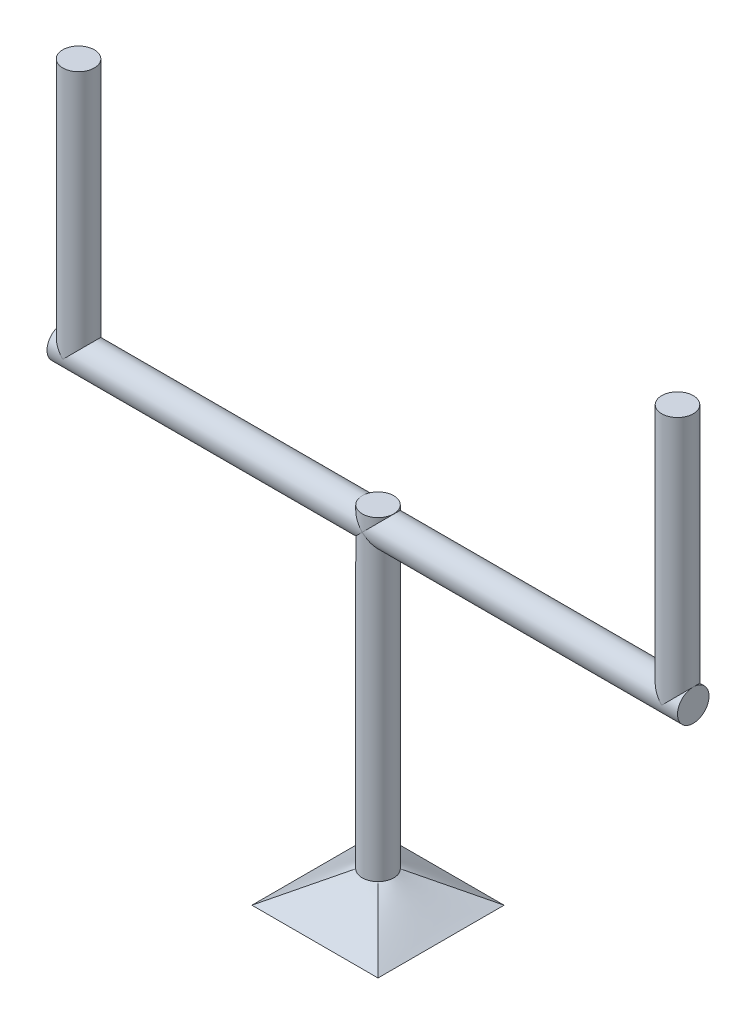
ISO-10303-21;
HEADER;
FILE_DESCRIPTION(('STEP AP214'),'2;1');
FILE_NAME('part.step','',(''),(''),'','','');
FILE_SCHEMA(('AUTOMOTIVE_DESIGN { 1 0 10303 214 1 1 1 1 }'));
ENDSEC;
DATA;
#1=APPLICATION_CONTEXT('core data for automotive mechanical design processes');
#2=APPLICATION_PROTOCOL_DEFINITION('international standard','automotive_design',2000,#1);
#3=PRODUCT_CONTEXT('',#1,'mechanical');
#4=PRODUCT('Part','Part','',(#3));
#5=PRODUCT_RELATED_PRODUCT_CATEGORY('part','',(#4));
#6=PRODUCT_DEFINITION_FORMATION('','',#4);
#7=PRODUCT_DEFINITION_CONTEXT('part definition',#1,'design');
#8=PRODUCT_DEFINITION('design','',#6,#7);
#9=PRODUCT_DEFINITION_SHAPE('','',#8);
#10=(LENGTH_UNIT() NAMED_UNIT(*) SI_UNIT(.MILLI.,.METRE.));
#11=(NAMED_UNIT(*) PLANE_ANGLE_UNIT() SI_UNIT($,.RADIAN.));
#12=(NAMED_UNIT(*) SI_UNIT($,.STERADIAN.) SOLID_ANGLE_UNIT());
#13=UNCERTAINTY_MEASURE_WITH_UNIT(LENGTH_MEASURE(1.E-05),#10,'distance_accuracy_value','');
#14=(GEOMETRIC_REPRESENTATION_CONTEXT(3) GLOBAL_UNCERTAINTY_ASSIGNED_CONTEXT((#13)) GLOBAL_UNIT_ASSIGNED_CONTEXT((#10,
#11,#12)) REPRESENTATION_CONTEXT('',''));
#15=CARTESIAN_POINT('',(0.,0.,0.));
#16=DIRECTION('',(0.,0.,1.));
#17=DIRECTION('',(1.,0.,0.));
#18=AXIS2_PLACEMENT_3D('',#15,#16,#17);
#19=CARTESIAN_POINT('',(127.,120.582635399218,0.));
#20=DIRECTION('',(-1.,0.,0.));
#21=DIRECTION('',(0.,0.,1.));
#22=AXIS2_PLACEMENT_3D('',#19,#20,#21);
#23=CYLINDRICAL_SURFACE('',#22,6.35);
#24=CARTESIAN_POINT('',(0.,120.582635399218,0.));
#25=DIRECTION('',(0.707106781186547,-0.707106781186547,0.));
#26=DIRECTION('',(-0.707106781186547,-0.707106781186547,0.));
#27=AXIS2_PLACEMENT_3D('',#24,#25,#26);
#28=ELLIPSE('',#27,8.98025612106915,6.35);
#29=CARTESIAN_POINT('',(0.,120.582635399218,-6.35));
#30=VERTEX_POINT('',#29);
#31=CARTESIAN_POINT('',(0.,120.582635399218,6.35));
#32=VERTEX_POINT('',#31);
#33=EDGE_CURVE('E384',#30,#32,#28,.F.);
#34=ORIENTED_EDGE('',*,*,#33,.T.);
#35=CARTESIAN_POINT('',(0.,120.582635399218,0.));
#36=DIRECTION('',(-0.707106781186547,-0.707106781186547,0.));
#37=DIRECTION('',(0.707106781186547,-0.707106781186547,0.));
#38=AXIS2_PLACEMENT_3D('',#35,#36,#37);
#39=ELLIPSE('',#38,8.98025612106915,6.35);
#40=EDGE_CURVE('E353',#32,#30,#39,.T.);
#41=ORIENTED_EDGE('',*,*,#40,.T.);
#42=EDGE_LOOP('',(#34,#41));
#43=FACE_BOUND('',#42,.T.);
#44=CARTESIAN_POINT('',(-120.65,120.65,0.));
#45=DIRECTION('',(0.,1.,0.));
#46=DIRECTION('',(0.0106085985482646,0.,-0.999943727235109));
#47=AXIS2_PLACEMENT_3D('',#44,#45,#46);
#48=CIRCLE('',#47,6.35);
#49=CARTESIAN_POINT('',(-120.582635399218,120.65,-6.34964266794293));
#50=VERTEX_POINT('',#49);
#51=CARTESIAN_POINT('',(-120.717364600782,120.65,-6.34964266794293));
#52=VERTEX_POINT('',#51);
#53=EDGE_CURVE('E12',#50,#52,#48,.T.);
#54=ORIENTED_EDGE('',*,*,#53,.F.);
#55=CARTESIAN_POINT('',(-120.65,120.582635399218,0.));
#56=DIRECTION('',(-0.707106781186547,0.707106781186547,0.));
#57=DIRECTION('',(-0.707106781186547,-0.707106781186547,0.));
#58=AXIS2_PLACEMENT_3D('',#55,#56,#57);
#59=ELLIPSE('',#58,8.98025612106915,6.35);
#60=CARTESIAN_POINT('',(-120.582635399219,120.65,6.34964266794294));
#61=VERTEX_POINT('',#60);
#62=EDGE_CURVE('E165',#61,#50,#59,.T.);
#63=ORIENTED_EDGE('',*,*,#62,.F.);
#64=CARTESIAN_POINT('',(-120.65,120.65,0.));
#65=DIRECTION('',(0.,1.,0.));
#66=DIRECTION('',(-0.0106085985482646,0.,0.999943727235109));
#67=AXIS2_PLACEMENT_3D('',#64,#65,#66);
#68=CIRCLE('',#67,6.35);
#69=CARTESIAN_POINT('',(-120.717364600781,120.65,6.34964266794294));
#70=VERTEX_POINT('',#69);
#71=EDGE_CURVE('E349',#70,#61,#68,.T.);
#72=ORIENTED_EDGE('',*,*,#71,.F.);
#73=CARTESIAN_POINT('',(-120.65,120.582635399218,0.));
#74=DIRECTION('',(-0.707106781186547,-0.707106781186547,0.));
#75=DIRECTION('',(-0.707106781186547,0.707106781186547,0.));
#76=AXIS2_PLACEMENT_3D('',#73,#74,#75);
#77=ELLIPSE('',#76,8.98025612106915,6.35);
#78=CARTESIAN_POINT('',(-127.,126.932635399218,0.));
#79=VERTEX_POINT('',#78);
#80=EDGE_CURVE('E160',#79,#70,#77,.F.);
#81=ORIENTED_EDGE('',*,*,#80,.F.);
#82=CARTESIAN_POINT('',(-127.,120.582635399218,0.));
#83=DIRECTION('',(1.,0.,0.));
#84=DIRECTION('',(0.,0.,-1.));
#85=AXIS2_PLACEMENT_3D('',#82,#83,#84);
#86=CIRCLE('',#85,6.35);
#87=EDGE_CURVE('E157',#79,#79,#86,.T.);
#88=ORIENTED_EDGE('',*,*,#87,.T.);
#89=EDGE_CURVE('E78',#52,#79,#77,.F.);
#90=ORIENTED_EDGE('',*,*,#89,.F.);
#91=EDGE_LOOP('',(#54,#63,#72,#81,#88,#90));
#92=FACE_BOUND('',#91,.T.);
#93=ADVANCED_FACE('F63',(#43,#92),#23,.T.);
#94=CARTESIAN_POINT('',(0.,127.,0.));
#95=DIRECTION('',(0.,-1.,0.));
#96=DIRECTION('',(0.,0.,-1.));
#97=AXIS2_PLACEMENT_3D('',#94,#95,#96);
#98=CYLINDRICAL_SURFACE('',#97,6.35);
#99=CARTESIAN_POINT('',(0.,127.,0.));
#100=DIRECTION('',(0.,1.,0.));
#101=DIRECTION('',(0.,0.,1.));
#102=AXIS2_PLACEMENT_3D('',#99,#100,#101);
#103=CIRCLE('',#102,6.35);
#104=CARTESIAN_POINT('',(0.,127.,6.35));
#105=VERTEX_POINT('',#104);
#106=EDGE_CURVE('E385',#105,#105,#103,.T.);
#107=ORIENTED_EDGE('',*,*,#106,.F.);
#108=EDGE_LOOP('',(#107));
#109=FACE_BOUND('',#108,.T.);
#110=ORIENTED_EDGE('',*,*,#40,.F.);
#111=CARTESIAN_POINT('',(0.,120.582635399218,0.));
#112=DIRECTION('',(0.707106781186547,-0.707106781186547,0.));
#113=DIRECTION('',(-0.707106781186547,-0.707106781186547,0.));
#114=AXIS2_PLACEMENT_3D('',#111,#112,#113);
#115=ELLIPSE('',#114,8.98025612106915,6.35);
#116=EDGE_CURVE('E359',#30,#32,#115,.T.);
#117=ORIENTED_EDGE('',*,*,#116,.F.);
#118=EDGE_LOOP('',(#110,#117));
#119=FACE_BOUND('',#118,.T.);
#120=ADVANCED_FACE('F470',(#109,#119),#98,.T.);
#121=CARTESIAN_POINT('',(0.,127.,0.));
#122=DIRECTION('',(0.,1.,0.));
#123=DIRECTION('',(0.,0.,1.));
#124=AXIS2_PLACEMENT_3D('',#121,#122,#123);
#125=PLANE('',#124);
#126=ORIENTED_EDGE('',*,*,#106,.T.);
#127=EDGE_LOOP('',(#126));
#128=FACE_BOUND('',#127,.T.);
#129=ADVANCED_FACE('F198',(#128),#125,.T.);
#130=CARTESIAN_POINT('',(-127.,120.582635399218,0.));
#131=DIRECTION('',(1.,0.,0.));
#132=DIRECTION('',(0.,0.,-1.));
#133=AXIS2_PLACEMENT_3D('',#130,#131,#132);
#134=PLANE('',#133);
#135=ORIENTED_EDGE('',*,*,#87,.F.);
#136=EDGE_LOOP('',(#135));
#137=FACE_BOUND('',#136,.T.);
#138=ADVANCED_FACE('F195',(#137),#134,.F.);
#139=CARTESIAN_POINT('',(4.49012806053458,0.,4.49012806053458));
#140=CARTESIAN_POINT('',(4.61643124207085,-2.33178128618747E-05,4.36385203866966));
#141=CARTESIAN_POINT('',(4.7373778405723,-2.19175783070193E-05,4.23222333438811));
#142=CARTESIAN_POINT('',(4.96775629632692,-9.16700494277595E-06,3.95925830150411));
#143=CARTESIAN_POINT('',(5.07718870564439,2.18285657378845E-06,3.81792243886278));
#144=CARTESIAN_POINT('',(5.2836714372294,-4.64538700999097E-06,3.52663861619785));
#145=CARTESIAN_POINT('',(5.38073105313292,-2.28011867529385E-05,3.37669724431938));
#146=CARTESIAN_POINT('',(5.56187894595311,-2.89153831323274E-05,3.06917635109191));
#147=CARTESIAN_POINT('',(5.64596738119262,-1.68741483768546E-05,2.91159692300189));
#148=CARTESIAN_POINT('',(5.80061344444988,-8.46625248314103E-06,2.58983810894827));
#149=CARTESIAN_POINT('',(5.87116445713793,-1.21072344976676E-05,2.425655543392));
#150=CARTESIAN_POINT('',(5.99818339192265,-3.23563401649273E-05,2.09193027626887));
#151=CARTESIAN_POINT('',(6.0546513121414,-4.89644655467767E-05,1.92238757398727));
#152=CARTESIAN_POINT('',(6.15309388946281,-3.10283776643288E-05,1.57917737523775));
#153=CARTESIAN_POINT('',(6.19507106322084,3.50694783258006E-06,1.40551060061614));
#154=CARTESIAN_POINT('',(6.26424720227014,-8.56140797221803E-06,1.05525927062413));
#155=CARTESIAN_POINT('',(6.29144624717535,-5.51646521519418E-05,0.878674730977821));
#156=CARTESIAN_POINT('',(6.33087293576002,-6.11923533612069E-05,0.523843876422744));
#157=CARTESIAN_POINT('',(6.34310072613804,-2.06176646302888E-05,0.345597577814266));
#158=CARTESIAN_POINT('',(6.35249851502318,-2.64462038526152E-06,-0.0112924659361107));
#159=CARTESIAN_POINT('',(6.34966843312858,-2.5246602203537E-05,-0.189936213195102));
#160=CARTESIAN_POINT('',(6.32896829012093,-5.160688057879E-05,-0.546386298425727));
#161=CARTESIAN_POINT('',(6.31109520607782,-5.53613886311435E-05,-0.724192460860188));
#162=CARTESIAN_POINT('',(6.26043268482651,-3.05684840043481E-05,-1.07766393969281));
#163=CARTESIAN_POINT('',(6.22764347719138,-2.02156846420216E-06,-1.25332928899736));
#164=CARTESIAN_POINT('',(6.14737458616766,-1.02751183932665E-05,-1.60130342506716));
#165=CARTESIAN_POINT('',(6.0998923632409,-4.70868856606809E-05,-1.77361162610676));
#166=CARTESIAN_POINT('',(5.99057516809344,-4.65158550830075E-05,-2.11362323612905));
#167=CARTESIAN_POINT('',(5.92873931529125,-9.12850412992333E-06,-2.28132636188859));
#168=CARTESIAN_POINT('',(5.79118513229947,3.73150867234298E-06,-2.61084809924551));
#169=CARTESIAN_POINT('',(5.71547373316804,-2.07649952560343E-05,-2.772669600662));
#170=CARTESIAN_POINT('',(5.55072660636818,-3.14112607491265E-05,-3.08930360819422));
#171=CARTESIAN_POINT('',(5.46169408930313,-1.75702482327545E-05,-3.24411779150747));
#172=CARTESIAN_POINT('',(5.24095684644915,-5.25672571452156E-06,-3.59301303581371));
#173=CARTESIAN_POINT('',(5.10462119016546,-1.29561399905685E-05,-3.78420421693197));
#174=CARTESIAN_POINT('',(4.88508646656854,-1.47963213842509E-05,-4.05859112147535));
#175=CARTESIAN_POINT('',(4.80944447533399,-1.37944737664931E-05,-4.14794531004179));
#176=CARTESIAN_POINT('',(4.65334667735874,-8.94017891535775E-06,-4.32233116729548));
#177=CARTESIAN_POINT('',(4.57289128795634,-5.08797848915939E-06,-4.40736320954877));
#178=CARTESIAN_POINT('',(4.49012806053458,0.,-4.49012806053458));
#179=B_SPLINE_CURVE_WITH_KNOTS('',3,(#139,#140,#141,#142,#143,#144,#145,#146,#147,#148,#149,
#150,#151,#152,#153,#154,#155,#156,#157,#158,#159,#160,#161,#162,#163,#164,#165,#166,#167,#168,
#169,#170,#171,#172,#173,#174,#175,#176,#177,#178),.UNSPECIFIED.,.F.,.F.,(4,2,2,2,2,2,2,2,2,2,2,
2,2,2,2,2,2,2,2,4),(0.,0.535637859532728,1.07125002542707,1.60645747358852,2.14165838863054,
2.67712017783155,3.21258203843425,3.74795085678134,4.28331679091743,4.8186774791312,
5.3540410259135,5.8895121810738,6.42497509511201,6.96053061020865,7.49611898981302,
8.03144056002565,8.56663331635743,9.26946593615011,9.62053232357192,9.97156831631189),.UNSPECIFIED.);
#180=CARTESIAN_POINT('',(4.49012806053458,0.,4.49012806053458));
#181=VERTEX_POINT('',#180);
#182=CARTESIAN_POINT('',(4.49012806053458,0.,-4.49012806053457));
#183=VERTEX_POINT('',#182);
#184=EDGE_CURVE('E68',#181,#183,#179,.T.);
#185=ORIENTED_EDGE('',*,*,#184,.T.);
#186=CARTESIAN_POINT('',(-4.49012806053458,0.,-4.49012806053458));
#187=CARTESIAN_POINT('',(-4.36385203866966,-2.33178128619306E-05,-4.61643124207086));
#188=CARTESIAN_POINT('',(-4.23222333438811,-2.19175783066482E-05,-4.7373778405723));
#189=CARTESIAN_POINT('',(-3.95925830150411,-9.16700494163517E-06,-4.96775629632692));
#190=CARTESIAN_POINT('',(-3.81792243886278,2.1828565752719E-06,-5.07718870564439));
#191=CARTESIAN_POINT('',(-3.52663861619785,-4.64538700895606E-06,-5.2836714372294));
#192=CARTESIAN_POINT('',(-3.37669724431938,-2.28011867526941E-05,-5.38073105313292));
#193=CARTESIAN_POINT('',(-3.06917635109191,-2.89153831322365E-05,-5.56187894595311));
#194=CARTESIAN_POINT('',(-2.91159692300189,-1.68741483761269E-05,-5.64596738119262));
#195=CARTESIAN_POINT('',(-2.58983810894826,-8.46625248216166E-06,-5.80061344444988));
#196=CARTESIAN_POINT('',(-2.42565554339199,-1.21072344970739E-05,-5.87116445713793));
#197=CARTESIAN_POINT('',(-2.09193027626887,-3.23563401650347E-05,-5.99818339192265));
#198=CARTESIAN_POINT('',(-1.92238757398726,-4.89644655471997E-05,-6.0546513121414));
#199=CARTESIAN_POINT('',(-1.57917737523774,-3.10283776643017E-05,-6.15309388946281));
#200=CARTESIAN_POINT('',(-1.40551060061614,3.50694783337263E-06,-6.19507106322084));
#201=CARTESIAN_POINT('',(-1.05525927062413,-8.56140797096396E-06,-6.26424720227014));
#202=CARTESIAN_POINT('',(-0.878674730977817,-5.51646521509917E-05,-6.29144624717535));
#203=CARTESIAN_POINT('',(-0.523843876422741,-6.11923533614653E-05,-6.33087293576002));
#204=CARTESIAN_POINT('',(-0.345597577814263,-2.06176646314518E-05,-6.34310072613804));
#205=CARTESIAN_POINT('',(0.0112924659361129,-2.64462038719126E-06,-6.35249851502318));
#206=CARTESIAN_POINT('',(0.189936213195104,-2.52466022053287E-05,-6.34966843312858));
#207=CARTESIAN_POINT('',(0.546386298425728,-5.16068805793351E-05,-6.32896829012093));
#208=CARTESIAN_POINT('',(0.72419246086019,-5.53613886305797E-05,-6.31109520607783));
#209=CARTESIAN_POINT('',(1.07766393969281,-3.05684840039316E-05,-6.26043268482651));
#210=CARTESIAN_POINT('',(1.25332928899736,-2.02156846504173E-06,-6.22764347719136));
#211=CARTESIAN_POINT('',(1.60130342506716,-1.02751183943368E-05,-6.14737458616764));
#212=CARTESIAN_POINT('',(1.77361162610676,-4.70868856607255E-05,-6.09989236324089));
#213=CARTESIAN_POINT('',(2.11362323612906,-4.65158550827342E-05,-5.99057516809344));
#214=CARTESIAN_POINT('',(2.28132636188859,-9.12850413035833E-06,-5.92873931529125));
#215=CARTESIAN_POINT('',(2.61084809924551,3.73150867261603E-06,-5.79118513229947));
#216=CARTESIAN_POINT('',(2.772669600662,-2.07649952543458E-05,-5.71547373316804));
#217=CARTESIAN_POINT('',(3.08930360819423,-3.14112607468282E-05,-5.55072660636818));
#218=CARTESIAN_POINT('',(3.24411779150748,-1.75702482312613E-05,-5.46169408930313));
#219=CARTESIAN_POINT('',(3.59301303581371,-5.2567257137249E-06,-5.24095684644915));
#220=CARTESIAN_POINT('',(3.78420421693197,-1.29561399892984E-05,-5.10462119016545));
#221=CARTESIAN_POINT('',(4.05859112147535,-1.47963213827909E-05,-4.88508646656854));
#222=CARTESIAN_POINT('',(4.1479453100418,-1.37944737650564E-05,-4.80944447533399));
#223=CARTESIAN_POINT('',(4.32233116729549,-8.94017891432522E-06,-4.65334667735874));
#224=CARTESIAN_POINT('',(4.40736320954877,-5.08797848850765E-06,-4.57289128795633));
#225=CARTESIAN_POINT('',(4.49012806053458,0.,-4.49012806053458));
#226=B_SPLINE_CURVE_WITH_KNOTS('',3,(#186,#187,#188,#189,#190,#191,#192,#193,#194,#195,#196,
#197,#198,#199,#200,#201,#202,#203,#204,#205,#206,#207,#208,#209,#210,#211,#212,#213,#214,#215,
#216,#217,#218,#219,#220,#221,#222,#223,#224,#225),.UNSPECIFIED.,.F.,.F.,(4,2,2,2,2,2,2,2,2,2,2,
2,2,2,2,2,2,2,2,4),(0.,0.535637859532728,1.07125002542706,1.60645747358852,2.14165838863054,
2.67712017783155,3.21258203843426,3.74795085678134,4.28331679091743,4.8186774791312,
5.35404102591349,5.88951218107379,6.42497509511201,6.96053061020865,7.49611898981302,
8.03144056002564,8.56663331635743,9.2694659361501,9.62053232357192,9.97156831631188),.UNSPECIFIED.);
#227=CARTESIAN_POINT('',(-4.49012806053458,0.,-4.49012806053458));
#228=VERTEX_POINT('',#227);
#229=EDGE_CURVE('E106',#228,#183,#226,.T.);
#230=ORIENTED_EDGE('',*,*,#229,.F.);
#231=CARTESIAN_POINT('',(-4.49012806053458,0.,4.49012806053458));
#232=CARTESIAN_POINT('',(-4.61643124207086,-2.33178128619424E-05,4.36385203866965));
#233=CARTESIAN_POINT('',(-4.7373778405723,-2.19175783071109E-05,4.23222333438811));
#234=CARTESIAN_POINT('',(-4.96775629632692,-9.16700494276771E-06,3.95925830150411));
#235=CARTESIAN_POINT('',(-5.07718870564439,2.18285657392041E-06,3.81792243886278));
#236=CARTESIAN_POINT('',(-5.2836714372294,-4.64538700940412E-06,3.52663861619785));
#237=CARTESIAN_POINT('',(-5.38073105313292,-2.28011867520208E-05,3.37669724431938));
#238=CARTESIAN_POINT('',(-5.56187894595311,-2.89153831315126E-05,3.06917635109191));
#239=CARTESIAN_POINT('',(-5.64596738119262,-1.68741483764736E-05,2.91159692300189));
#240=CARTESIAN_POINT('',(-5.80061344444988,-8.46625248355256E-06,2.58983810894826));
#241=CARTESIAN_POINT('',(-5.87116445713793,-1.21072344984378E-05,2.42565554339199));
#242=CARTESIAN_POINT('',(-5.99818339192265,-3.23563401655399E-05,2.09193027626886));
#243=CARTESIAN_POINT('',(-6.0546513121414,-4.89644655468732E-05,1.92238757398726));
#244=CARTESIAN_POINT('',(-6.15309388946281,-3.10283776629829E-05,1.57917737523774));
#245=CARTESIAN_POINT('',(-6.19507106322084,3.50694783485206E-06,1.40551060061614));
#246=CARTESIAN_POINT('',(-6.26424720227014,-8.56140797057354E-06,1.05525927062412));
#247=CARTESIAN_POINT('',(-6.29144624717535,-5.51646521518509E-05,0.878674730977817));
#248=CARTESIAN_POINT('',(-6.33087293576002,-6.1192353361435E-05,0.52384387642274));
#249=CARTESIAN_POINT('',(-6.34310072613804,-2.06176646292824E-05,0.345597577814262));
#250=CARTESIAN_POINT('',(-6.35249851502318,-2.64462038455084E-06,-0.0112924659361142));
#251=CARTESIAN_POINT('',(-6.34966843312858,-2.52466022043564E-05,-0.189936213195105));
#252=CARTESIAN_POINT('',(-6.32896829012093,-5.16068805798621E-05,-0.546386298425729));
#253=CARTESIAN_POINT('',(-6.31109520607782,-5.53613886309375E-05,-0.724192460860192));
#254=CARTESIAN_POINT('',(-6.26043268482651,-3.0568484004236E-05,-1.07766393969281));
#255=CARTESIAN_POINT('',(-6.22764347719136,-2.02156846546214E-06,-1.25332928899736));
#256=CARTESIAN_POINT('',(-6.14737458616764,-1.02751183946107E-05,-1.60130342506716));
#257=CARTESIAN_POINT('',(-6.09989236324089,-4.70868856607368E-05,-1.77361162610676));
#258=CARTESIAN_POINT('',(-5.99057516809344,-4.65158550822808E-05,-2.11362323612906));
#259=CARTESIAN_POINT('',(-5.92873931529125,-9.12850412970277E-06,-2.28132636188859));
#260=CARTESIAN_POINT('',(-5.79118513229947,3.73150867291319E-06,-2.61084809924551));
#261=CARTESIAN_POINT('',(-5.71547373316804,-2.07649952546089E-05,-2.77266960066201));
#262=CARTESIAN_POINT('',(-5.55072660636818,-3.14112607470945E-05,-3.08930360819423));
#263=CARTESIAN_POINT('',(-5.46169408930313,-1.75702482309709E-05,-3.24411779150748));
#264=CARTESIAN_POINT('',(-5.24095684644915,-5.25672571324903E-06,-3.59301303581371));
#265=CARTESIAN_POINT('',(-5.10462119016545,-1.29561399895388E-05,-3.78420421693197));
#266=CARTESIAN_POINT('',(-4.88508646656854,-1.47963213831247E-05,-4.05859112147535));
#267=CARTESIAN_POINT('',(-4.80944447533399,-1.37944737652581E-05,-4.1479453100418));
#268=CARTESIAN_POINT('',(-4.65334667735874,-8.94017891430363E-06,-4.32233116729549));
#269=CARTESIAN_POINT('',(-4.57289128795634,-5.08797848839486E-06,-4.40736320954877));
#270=CARTESIAN_POINT('',(-4.49012806053458,0.,-4.49012806053458));
#271=B_SPLINE_CURVE_WITH_KNOTS('',3,(#231,#232,#233,#234,#235,#236,#237,#238,#239,#240,#241,
#242,#243,#244,#245,#246,#247,#248,#249,#250,#251,#252,#253,#254,#255,#256,#257,#258,#259,#260,
#261,#262,#263,#264,#265,#266,#267,#268,#269,#270),.UNSPECIFIED.,.F.,.F.,(4,2,2,2,2,2,2,2,2,2,2,
2,2,2,2,2,2,2,2,4),(0.,0.535637859532727,1.07125002542706,1.60645747358852,2.14165838863054,
2.67712017783155,3.21258203843426,3.74795085678134,4.28331679091743,4.8186774791312,
5.3540410259135,5.88951218107379,6.42497509511201,6.96053061020865,7.49611898981302,
8.03144056002564,8.56663331635743,9.2694659361501,9.62053232357192,9.97156831631188),.UNSPECIFIED.);
#272=CARTESIAN_POINT('',(-4.49012806053458,0.,4.49012806053457));
#273=VERTEX_POINT('',#272);
#274=EDGE_CURVE('E234',#273,#228,#271,.T.);
#275=ORIENTED_EDGE('',*,*,#274,.F.);
#276=CARTESIAN_POINT('',(4.49012806053458,0.,4.49012806053458));
#277=CARTESIAN_POINT('',(4.36385203866966,-2.33178128612673E-05,4.61643124207085));
#278=CARTESIAN_POINT('',(4.23222333438811,-2.19175783063626E-05,4.7373778405723));
#279=CARTESIAN_POINT('',(3.95925830150411,-9.16700494231888E-06,4.96775629632692));
#280=CARTESIAN_POINT('',(3.81792243886278,2.18285657399661E-06,5.07718870564439));
#281=CARTESIAN_POINT('',(3.52663861619785,-4.64538700976116E-06,5.2836714372294));
#282=CARTESIAN_POINT('',(3.37669724431938,-2.28011867524386E-05,5.38073105313292));
#283=CARTESIAN_POINT('',(3.06917635109191,-2.89153831317392E-05,5.56187894595311));
#284=CARTESIAN_POINT('',(2.91159692300189,-1.68741483764482E-05,5.64596738119262));
#285=CARTESIAN_POINT('',(2.58983810894826,-8.46625248387062E-06,5.80061344444988));
#286=CARTESIAN_POINT('',(2.42565554339199,-1.21072344993519E-05,5.87116445713793));
#287=CARTESIAN_POINT('',(2.09193027626887,-3.23563401664942E-05,5.99818339192265));
#288=CARTESIAN_POINT('',(1.92238757398726,-4.89644655472718E-05,6.0546513121414));
#289=CARTESIAN_POINT('',(1.57917737523774,-3.10283776634279E-05,6.15309388946281));
#290=CARTESIAN_POINT('',(1.40551060061614,3.50694783380518E-06,6.19507106322084));
#291=CARTESIAN_POINT('',(1.05525927062412,-8.56140797129107E-06,6.26424720227014));
#292=CARTESIAN_POINT('',(0.878674730977816,-5.51646521516372E-05,6.29144624717535));
#293=CARTESIAN_POINT('',(0.523843876422739,-6.11923533609485E-05,6.33087293576002));
#294=CARTESIAN_POINT('',(0.345597577814262,-2.06176646294543E-05,6.34310072613804));
#295=CARTESIAN_POINT('',(-0.0112924659361145,-2.6446203856638E-06,6.35249851502318));
#296=CARTESIAN_POINT('',(-0.189936213195105,-2.5246602205752E-05,6.34966843312858));
#297=CARTESIAN_POINT('',(-0.546386298425729,-5.16068805806863E-05,6.32896829012093));
#298=CARTESIAN_POINT('',(-0.724192460860192,-5.53613886309075E-05,6.31109520607782));
#299=CARTESIAN_POINT('',(-1.07766393969281,-3.05684840032106E-05,6.26043268482651));
#300=CARTESIAN_POINT('',(-1.25332928899736,-2.02156846429555E-06,6.22764347719136));
#301=CARTESIAN_POINT('',(-1.60130342506716,-1.02751183938614E-05,6.14737458616764));
#302=CARTESIAN_POINT('',(-1.77361162610677,-4.7086885660546E-05,6.09989236324089));
#303=CARTESIAN_POINT('',(-2.11362323612906,-4.65158550830553E-05,5.99057516809344));
#304=CARTESIAN_POINT('',(-2.28132636188859,-9.128504130884E-06,5.92873931529125));
#305=CARTESIAN_POINT('',(-2.61084809924551,3.73150867173913E-06,5.79118513229947));
#306=CARTESIAN_POINT('',(-2.77266960066201,-2.07649952553694E-05,5.71547373316804));
#307=CARTESIAN_POINT('',(-3.08930360819423,-3.14112607475292E-05,5.55072660636818));
#308=CARTESIAN_POINT('',(-3.24411779150748,-1.75702482314932E-05,5.46169408930313));
#309=CARTESIAN_POINT('',(-3.59301303581371,-5.25672571320343E-06,5.24095684644915));
#310=CARTESIAN_POINT('',(-3.78420421693197,-1.29561399885966E-05,5.10462119016545));
#311=CARTESIAN_POINT('',(-4.05859112147535,-1.47963213835383E-05,4.88508646656854));
#312=CARTESIAN_POINT('',(-4.1479453100418,-1.37944737665728E-05,4.80944447533399));
#313=CARTESIAN_POINT('',(-4.32233116729549,-8.94017891630277E-06,4.65334667735874));
#314=CARTESIAN_POINT('',(-4.40736320954877,-5.08797849017762E-06,4.57289128795633));
#315=CARTESIAN_POINT('',(-4.49012806053458,0.,4.49012806053457));
#316=B_SPLINE_CURVE_WITH_KNOTS('',3,(#276,#277,#278,#279,#280,#281,#282,#283,#284,#285,#286,
#287,#288,#289,#290,#291,#292,#293,#294,#295,#296,#297,#298,#299,#300,#301,#302,#303,#304,#305,
#306,#307,#308,#309,#310,#311,#312,#313,#314,#315),.UNSPECIFIED.,.F.,.F.,(4,2,2,2,2,2,2,2,2,2,2,
2,2,2,2,2,2,2,2,4),(0.,0.535637859532727,1.07125002542707,1.60645747358852,2.14165838863054,
2.67712017783156,3.21258203843426,3.74795085678135,4.28331679091743,4.8186774791312,
5.3540410259135,5.8895121810738,6.42497509511201,6.96053061020865,7.49611898981302,
8.03144056002565,8.56663331635743,9.26946593615011,9.62053232357193,9.97156831631189),.UNSPECIFIED.);
#317=EDGE_CURVE('E112',#181,#273,#316,.T.);
#318=ORIENTED_EDGE('',*,*,#317,.F.);
#319=EDGE_LOOP('',(#185,#230,#275,#318));
#320=FACE_BOUND('',#319,.T.);
#321=CARTESIAN_POINT('',(0.,120.582635399218,0.));
#322=DIRECTION('',(-0.707106781186547,-0.707106781186547,0.));
#323=DIRECTION('',(0.707106781186547,-0.707106781186547,0.));
#324=AXIS2_PLACEMENT_3D('',#321,#322,#323);
#325=ELLIPSE('',#324,8.98025612106915,6.35);
#326=EDGE_CURVE('E350',#32,#30,#325,.F.);
#327=ORIENTED_EDGE('',*,*,#326,.F.);
#328=ORIENTED_EDGE('',*,*,#33,.F.);
#329=EDGE_LOOP('',(#327,#328));
#330=FACE_BOUND('',#329,.T.);
#331=ADVANCED_FACE('F65',(#320,#330),#98,.T.);
#332=CARTESIAN_POINT('',(120.65,120.582635399218,0.));
#333=DIRECTION('',(-0.707106781186547,0.707106781186547,0.));
#334=DIRECTION('',(-0.707106781186547,-0.707106781186547,0.));
#335=AXIS2_PLACEMENT_3D('',#332,#333,#334);
#336=ELLIPSE('',#335,8.98025612106915,6.35);
#337=CARTESIAN_POINT('',(120.717364600781,120.65,6.34964266794294));
#338=VERTEX_POINT('',#337);
#339=CARTESIAN_POINT('',(127.,126.932635399218,0.));
#340=VERTEX_POINT('',#339);
#341=EDGE_CURVE('E373',#338,#340,#336,.T.);
#342=ORIENTED_EDGE('',*,*,#341,.F.);
#343=CARTESIAN_POINT('',(120.65,120.65,0.));
#344=DIRECTION('',(0.,1.,0.));
#345=DIRECTION('',(-0.0106085985482646,0.,0.999943727235109));
#346=AXIS2_PLACEMENT_3D('',#343,#344,#345);
#347=CIRCLE('',#346,6.35);
#348=CARTESIAN_POINT('',(120.582635399219,120.65,6.34964266794294));
#349=VERTEX_POINT('',#348);
#350=EDGE_CURVE('E230',#349,#338,#347,.T.);
#351=ORIENTED_EDGE('',*,*,#350,.F.);
#352=CARTESIAN_POINT('',(120.65,120.582635399218,0.));
#353=DIRECTION('',(-0.707106781186547,-0.707106781186547,0.));
#354=DIRECTION('',(-0.707106781186547,0.707106781186547,0.));
#355=AXIS2_PLACEMENT_3D('',#352,#353,#354);
#356=ELLIPSE('',#355,8.98025612106915,6.35);
#357=CARTESIAN_POINT('',(120.582635399219,120.65,-6.34964266794294));
#358=VERTEX_POINT('',#357);
#359=EDGE_CURVE('E348',#358,#349,#356,.F.);
#360=ORIENTED_EDGE('',*,*,#359,.F.);
#361=CARTESIAN_POINT('',(120.65,120.65,0.));
#362=DIRECTION('',(0.,1.,0.));
#363=DIRECTION('',(0.0106085985482646,0.,-0.999943727235109));
#364=AXIS2_PLACEMENT_3D('',#361,#362,#363);
#365=CIRCLE('',#364,6.35);
#366=CARTESIAN_POINT('',(120.717364600781,120.65,-6.34964266794294));
#367=VERTEX_POINT('',#366);
#368=EDGE_CURVE('E378',#367,#358,#365,.T.);
#369=ORIENTED_EDGE('',*,*,#368,.F.);
#370=EDGE_CURVE('E376',#340,#367,#336,.T.);
#371=ORIENTED_EDGE('',*,*,#370,.F.);
#372=CARTESIAN_POINT('',(127.,120.582635399218,0.));
#373=DIRECTION('',(1.,0.,0.));
#374=DIRECTION('',(0.,0.,-1.));
#375=AXIS2_PLACEMENT_3D('',#372,#373,#374);
#376=CIRCLE('',#375,6.35);
#377=EDGE_CURVE('E175',#340,#340,#376,.T.);
#378=ORIENTED_EDGE('',*,*,#377,.F.);
#379=EDGE_LOOP('',(#342,#351,#360,#369,#371,#378));
#380=FACE_BOUND('',#379,.T.);
#381=ORIENTED_EDGE('',*,*,#116,.T.);
#382=ORIENTED_EDGE('',*,*,#326,.T.);
#383=EDGE_LOOP('',(#381,#382));
#384=FACE_BOUND('',#383,.T.);
#385=ADVANCED_FACE('F193',(#380,#384),#23,.T.);
#386=CARTESIAN_POINT('',(127.,120.582635399218,0.));
#387=DIRECTION('',(1.,0.,0.));
#388=DIRECTION('',(0.,0.,-1.));
#389=AXIS2_PLACEMENT_3D('',#386,#387,#388);
#390=PLANE('',#389);
#391=ORIENTED_EDGE('',*,*,#377,.T.);
#392=EDGE_LOOP('',(#391));
#393=FACE_BOUND('',#392,.T.);
#394=ADVANCED_FACE('F187',(#393),#390,.T.);
#395=CARTESIAN_POINT('',(-120.65,222.25,0.));
#396=DIRECTION('',(0.,-1.,0.));
#397=DIRECTION('',(0.,0.,-1.));
#398=AXIS2_PLACEMENT_3D('',#395,#396,#397);
#399=CYLINDRICAL_SURFACE('',#398,6.35);
#400=CARTESIAN_POINT('',(-120.65,222.25,0.));
#401=DIRECTION('',(0.,1.,0.));
#402=DIRECTION('',(0.,0.,1.));
#403=AXIS2_PLACEMENT_3D('',#400,#401,#402);
#404=CIRCLE('',#403,6.35);
#405=CARTESIAN_POINT('',(-120.65,222.25,6.35));
#406=VERTEX_POINT('',#405);
#407=EDGE_CURVE('E341',#406,#406,#404,.T.);
#408=ORIENTED_EDGE('',*,*,#407,.F.);
#409=EDGE_LOOP('',(#408));
#410=FACE_BOUND('',#409,.T.);
#411=ORIENTED_EDGE('',*,*,#53,.T.);
#412=ORIENTED_EDGE('',*,*,#89,.T.);
#413=ORIENTED_EDGE('',*,*,#80,.T.);
#414=ORIENTED_EDGE('',*,*,#71,.T.);
#415=ORIENTED_EDGE('',*,*,#62,.T.);
#416=EDGE_LOOP('',(#411,#412,#413,#414,#415));
#417=FACE_BOUND('',#416,.T.);
#418=ADVANCED_FACE('F163',(#410,#417),#399,.T.);
#419=CARTESIAN_POINT('',(-120.65,222.25,0.));
#420=DIRECTION('',(0.,1.,0.));
#421=DIRECTION('',(0.,0.,1.));
#422=AXIS2_PLACEMENT_3D('',#419,#420,#421);
#423=PLANE('',#422);
#424=ORIENTED_EDGE('',*,*,#407,.T.);
#425=EDGE_LOOP('',(#424));
#426=FACE_BOUND('',#425,.T.);
#427=ADVANCED_FACE('F186',(#426),#423,.T.);
#428=CARTESIAN_POINT('',(120.65,222.25,0.));
#429=DIRECTION('',(0.,-1.,0.));
#430=DIRECTION('',(0.,0.,-1.));
#431=AXIS2_PLACEMENT_3D('',#428,#429,#430);
#432=CYLINDRICAL_SURFACE('',#431,6.35);
#433=CARTESIAN_POINT('',(120.65,222.25,0.));
#434=DIRECTION('',(0.,1.,0.));
#435=DIRECTION('',(0.,0.,-1.));
#436=AXIS2_PLACEMENT_3D('',#433,#434,#435);
#437=CIRCLE('',#436,6.35);
#438=CARTESIAN_POINT('',(120.65,222.25,-6.35));
#439=VERTEX_POINT('',#438);
#440=EDGE_CURVE('E374',#439,#439,#437,.T.);
#441=ORIENTED_EDGE('',*,*,#440,.F.);
#442=EDGE_LOOP('',(#441));
#443=FACE_BOUND('',#442,.T.);
#444=ORIENTED_EDGE('',*,*,#368,.T.);
#445=ORIENTED_EDGE('',*,*,#359,.T.);
#446=ORIENTED_EDGE('',*,*,#350,.T.);
#447=ORIENTED_EDGE('',*,*,#341,.T.);
#448=ORIENTED_EDGE('',*,*,#370,.T.);
#449=EDGE_LOOP('',(#444,#445,#446,#447,#448));
#450=FACE_BOUND('',#449,.T.);
#451=ADVANCED_FACE('F325',(#443,#450),#432,.T.);
#452=CARTESIAN_POINT('',(120.65,222.25,0.));
#453=DIRECTION('',(0.,-1.,0.));
#454=DIRECTION('',(0.,0.,-1.));
#455=AXIS2_PLACEMENT_3D('',#452,#453,#454);
#456=PLANE('',#455);
#457=ORIENTED_EDGE('',*,*,#440,.T.);
#458=EDGE_LOOP('',(#457));
#459=FACE_BOUND('',#458,.T.);
#460=ADVANCED_FACE('F317',(#459),#456,.F.);
#461=CARTESIAN_POINT('',(0.,-12.7,0.));
#462=DIRECTION('',(0.,-1.,0.));
#463=DIRECTION('',(0.,0.,-1.));
#464=AXIS2_PLACEMENT_3D('',#461,#462,#463);
#465=PLANE('',#464);
#466=DIRECTION('',(0.,0.,1.));
#467=VECTOR('',#466,1.);
#468=CARTESIAN_POINT('',(25.4,-12.7,25.4));
#469=LINE('',#468,#467);
#470=CARTESIAN_POINT('',(25.4,-12.7,-25.4));
#471=VERTEX_POINT('',#470);
#472=CARTESIAN_POINT('',(25.4,-12.7,25.4));
#473=VERTEX_POINT('',#472);
#474=EDGE_CURVE('E296',#471,#473,#469,.T.);
#475=ORIENTED_EDGE('',*,*,#474,.T.);
#476=DIRECTION('',(-1.,0.,0.));
#477=VECTOR('',#476,1.);
#478=CARTESIAN_POINT('',(-25.4,-12.7,25.4));
#479=LINE('',#478,#477);
#480=CARTESIAN_POINT('',(-25.4,-12.7,25.4));
#481=VERTEX_POINT('',#480);
#482=EDGE_CURVE('E405',#473,#481,#479,.T.);
#483=ORIENTED_EDGE('',*,*,#482,.T.);
#484=DIRECTION('',(0.,0.,-1.));
#485=VECTOR('',#484,1.);
#486=CARTESIAN_POINT('',(-25.4,-12.7,25.4));
#487=LINE('',#486,#485);
#488=CARTESIAN_POINT('',(-25.4,-12.7,-25.4));
#489=VERTEX_POINT('',#488);
#490=EDGE_CURVE('E421',#481,#489,#487,.T.);
#491=ORIENTED_EDGE('',*,*,#490,.T.);
#492=DIRECTION('',(1.,0.,0.));
#493=VECTOR('',#492,1.);
#494=CARTESIAN_POINT('',(-25.4,-12.7,-25.4));
#495=LINE('',#494,#493);
#496=EDGE_CURVE('E285',#489,#471,#495,.T.);
#497=ORIENTED_EDGE('',*,*,#496,.T.);
#498=EDGE_LOOP('',(#475,#483,#491,#497));
#499=FACE_BOUND('',#498,.T.);
#500=ADVANCED_FACE('F258',(#499),#465,.T.);
#501=CARTESIAN_POINT('',(-4.28102934113992,0.127,4.28102934113992));
#502=CARTESIAN_POINT('',(-4.49012806053458,0.,4.49012806053458));
#503=CARTESIAN_POINT('',(-25.4,-12.7,25.4));
#504=CARTESIAN_POINT('',(-4.54825850780659,0.127,4.03496684113992));
#505=CARTESIAN_POINT('',(-4.75471139386791,0.,4.22554472720124));
#506=CARTESIAN_POINT('',(-25.4,-12.7,23.2833333333333));
#507=CARTESIAN_POINT('',(-4.80172504177125,0.127,3.75515485669998));
#508=CARTESIAN_POINT('',(-5.00566835818935,0.,3.92754606273926));
#509=CARTESIAN_POINT('',(-25.4,-12.7,21.1666666666666));
#510=CARTESIAN_POINT('',(-5.2593279157528,0.127,3.13206697405423));
#511=CARTESIAN_POINT('',(-5.45874051064634,0.,3.26871317563125));
#512=CARTESIAN_POINT('',(-25.4,-12.7,16.9333333333333));
#513=CARTESIAN_POINT('',(-5.463316095672,0.127,2.78875709443814));
#514=CARTESIAN_POINT('',(-5.66070900561584,0.,2.90784530802456));
#515=CARTESIAN_POINT('',(-25.4,-12.7,14.8166666666666));
#516=CARTESIAN_POINT('',(-5.80055897342447,0.127,2.05183674193244));
#517=CARTESIAN_POINT('',(-5.99461284497472,0.,2.13630700521364));
#518=CARTESIAN_POINT('',(-25.4,-12.7,10.5833333333333));
#519=CARTESIAN_POINT('',(-5.93364837248196,0.127,1.65828727747923));
#520=CARTESIAN_POINT('',(-6.12638452720986,0.,1.72569697440188));
#521=CARTESIAN_POINT('',(-25.4,-12.7,8.4666666666666));
#522=CARTESIAN_POINT('',(-6.11317460579515,0.127,0.843086551359629));
#523=CARTESIAN_POINT('',(-6.30413327306451,0.,0.87665335118115));
#524=CARTESIAN_POINT('',(-25.4,-12.7,4.23333333333327));
#525=CARTESIAN_POINT('',(-6.1595,0.127,0.421593113713306));
#526=CARTESIAN_POINT('',(-6.35,0.,0.43837602017819));
#527=CARTESIAN_POINT('',(-25.4,-12.7,2.1166666666666));
#528=CARTESIAN_POINT('',(-6.1595,0.127,-0.421593113713309));
#529=CARTESIAN_POINT('',(-6.35,0.,-0.438376020178194));
#530=CARTESIAN_POINT('',(-25.4,-12.7,-2.11666666666673));
#531=CARTESIAN_POINT('',(-6.11317460579515,0.127,-0.843086551359632));
#532=CARTESIAN_POINT('',(-6.30413327306451,0.,-0.876653351181154));
#533=CARTESIAN_POINT('',(-25.4,-12.7,-4.2333333333334));
#534=CARTESIAN_POINT('',(-5.93364837248196,0.127,-1.65828727747923));
#535=CARTESIAN_POINT('',(-6.12638452720986,0.,-1.72569697440188));
#536=CARTESIAN_POINT('',(-25.4,-12.7,-8.46666666666673));
#537=CARTESIAN_POINT('',(-5.80055897342447,0.127,-2.05183674193244));
#538=CARTESIAN_POINT('',(-5.99461284497472,0.,-2.13630700521364));
#539=CARTESIAN_POINT('',(-25.4,-12.7,-10.5833333333334));
#540=CARTESIAN_POINT('',(-5.463316095672,0.127,-2.78875709443814));
#541=CARTESIAN_POINT('',(-5.66070900561584,0.,-2.90784530802456));
#542=CARTESIAN_POINT('',(-25.4,-12.7,-14.8166666666667));
#543=CARTESIAN_POINT('',(-5.2593279157528,0.127,-3.13206697405423));
#544=CARTESIAN_POINT('',(-5.45874051064634,0.,-3.26871317563125));
#545=CARTESIAN_POINT('',(-25.4,-12.7,-16.9333333333334));
#546=CARTESIAN_POINT('',(-4.80172504177125,0.127,-3.75515485669999));
#547=CARTESIAN_POINT('',(-5.00566835818935,0.,-3.92754606273926));
#548=CARTESIAN_POINT('',(-25.4,-12.7,-21.1666666666667));
#549=CARTESIAN_POINT('',(-4.54825850780659,0.127,-4.03496684113993));
#550=CARTESIAN_POINT('',(-4.75471139386791,0.,-4.22554472720125));
#551=CARTESIAN_POINT('',(-25.4,-12.7,-23.2833333333333));
#552=CARTESIAN_POINT('',(-4.28102934113992,0.127,-4.28102934113992));
#553=CARTESIAN_POINT('',(-4.49012806053458,0.,-4.49012806053458));
#554=CARTESIAN_POINT('',(-25.4,-12.7,-25.4));
#555=B_SPLINE_SURFACE_WITH_KNOTS('',3,1,((#501,#502,#503),(#504,#505,#506),(#507,#508,#509),
(#510,#511,#512),(#513,#514,#515),(#516,#517,#518),(#519,#520,#521),(#522,#523,#524),(#525,#526,
#527),(#528,#529,#530),(#531,#532,#533),(#534,#535,#536),(#537,#538,#539),(#540,#541,#542),
(#543,#544,#545),(#546,#547,#548),(#549,#550,#551),(#552,#553,#554)),.UNSPECIFIED.,.F.,.F.,.F.,
(4,2,2,2,2,2,2,2,4),(2,1,2),(0.,0.125,0.25,0.375,0.5,0.625,0.75,0.875,1.),(-0.01,0.,1.),.UNSPECIFIED.);
#556=DIRECTION('',(-0.649721060213873,-0.394620181730637,-0.649721060213873));
#557=VECTOR('',#556,1.);
#558=CARTESIAN_POINT('',(-14.9450640302673,-6.35,-14.9450640302673));
#559=LINE('',#558,#557);
#560=EDGE_CURVE('E86',#228,#489,#559,.T.);
#561=DIRECTION('',(0.649721060213873,0.394620181730637,-0.649721060213873));
#562=VECTOR('',#561,1.);
#563=CARTESIAN_POINT('',(-14.9450640302673,-6.35,14.9450640302673));
#564=LINE('',#563,#562);
#565=EDGE_CURVE('E403',#481,#273,#564,.T.);
#566=ORIENTED_EDGE('',*,*,#274,.T.);
#567=ORIENTED_EDGE('',*,*,#560,.T.);
#568=ORIENTED_EDGE('',*,*,#490,.F.);
#569=ORIENTED_EDGE('',*,*,#565,.T.);
#570=EDGE_LOOP('',(#566,#567,#568,#569));
#571=FACE_BOUND('',#570,.T.);
#572=ADVANCED_FACE('F250',(#571),#555,.T.);
#573=CARTESIAN_POINT('',(-4.28102934113992,0.127,-4.28102934113992));
#574=CARTESIAN_POINT('',(-4.49012806053458,0.,-4.49012806053458));
#575=CARTESIAN_POINT('',(-25.4,-12.7,-25.4));
#576=CARTESIAN_POINT('',(-4.03496684113992,0.127,-4.54825850780659));
#577=CARTESIAN_POINT('',(-4.22554472720124,0.,-4.75471139386791));
#578=CARTESIAN_POINT('',(-23.2833333333333,-12.7,-25.4));
#579=CARTESIAN_POINT('',(-3.75515485669998,0.127,-4.80172504177125));
#580=CARTESIAN_POINT('',(-3.92754606273926,0.,-5.00566835818935));
#581=CARTESIAN_POINT('',(-21.1666666666667,-12.7,-25.4));
#582=CARTESIAN_POINT('',(-3.13206697405423,0.127,-5.2593279157528));
#583=CARTESIAN_POINT('',(-3.26871317563125,0.,-5.45874051064634));
#584=CARTESIAN_POINT('',(-16.9333333333333,-12.7,-25.4));
#585=CARTESIAN_POINT('',(-2.78875709443814,0.127,-5.463316095672));
#586=CARTESIAN_POINT('',(-2.90784530802456,0.,-5.66070900561584));
#587=CARTESIAN_POINT('',(-14.8166666666667,-12.7,-25.4));
#588=CARTESIAN_POINT('',(-2.05183674193244,0.127,-5.80055897342447));
#589=CARTESIAN_POINT('',(-2.13630700521364,0.,-5.99461284497472));
#590=CARTESIAN_POINT('',(-10.5833333333333,-12.7,-25.4));
#591=CARTESIAN_POINT('',(-1.65828727747923,0.127,-5.93364837248196));
#592=CARTESIAN_POINT('',(-1.72569697440188,0.,-6.12638452720986));
#593=CARTESIAN_POINT('',(-8.46666666666666,-12.7,-25.4));
#594=CARTESIAN_POINT('',(-0.84308655135963,0.127,-6.11317460579515));
#595=CARTESIAN_POINT('',(-0.876653351181152,0.,-6.30413327306451));
#596=CARTESIAN_POINT('',(-4.23333333333333,-12.7,-25.4));
#597=CARTESIAN_POINT('',(-0.421593113713306,0.127,-6.1595));
#598=CARTESIAN_POINT('',(-0.438376020178191,0.,-6.35));
#599=CARTESIAN_POINT('',(-2.11666666666667,-12.7,-25.4));
#600=CARTESIAN_POINT('',(0.421593113713308,0.127,-6.1595));
#601=CARTESIAN_POINT('',(0.438376020178193,0.,-6.35));
#602=CARTESIAN_POINT('',(2.11666666666666,-12.7,-25.4));
#603=CARTESIAN_POINT('',(0.843086551359631,0.127,-6.11317460579515));
#604=CARTESIAN_POINT('',(0.876653351181153,0.,-6.30413327306451));
#605=CARTESIAN_POINT('',(4.23333333333333,-12.7,-25.4));
#606=CARTESIAN_POINT('',(1.65828727747923,0.127,-5.93364837248196));
#607=CARTESIAN_POINT('',(1.72569697440188,0.,-6.12638452720986));
#608=CARTESIAN_POINT('',(8.46666666666667,-12.7,-25.4));
#609=CARTESIAN_POINT('',(2.05183674193244,0.127,-5.80055897342446));
#610=CARTESIAN_POINT('',(2.13630700521364,0.,-5.99461284497472));
#611=CARTESIAN_POINT('',(10.5833333333333,-12.7,-25.4));
#612=CARTESIAN_POINT('',(2.78875709443814,0.127,-5.463316095672));
#613=CARTESIAN_POINT('',(2.90784530802456,0.,-5.66070900561584));
#614=CARTESIAN_POINT('',(14.8166666666667,-12.7,-25.4));
#615=CARTESIAN_POINT('',(3.13206697405423,0.127,-5.2593279157528));
#616=CARTESIAN_POINT('',(3.26871317563125,0.,-5.45874051064634));
#617=CARTESIAN_POINT('',(16.9333333333333,-12.7,-25.4));
#618=CARTESIAN_POINT('',(3.75515485669999,0.127,-4.80172504177125));
#619=CARTESIAN_POINT('',(3.92754606273926,0.,-5.00566835818936));
#620=CARTESIAN_POINT('',(21.1666666666667,-12.7,-25.4));
#621=CARTESIAN_POINT('',(4.03496684113992,0.127,-4.54825850780659));
#622=CARTESIAN_POINT('',(4.22554472720125,0.,-4.75471139386791));
#623=CARTESIAN_POINT('',(23.2833333333333,-12.7,-25.4));
#624=CARTESIAN_POINT('',(4.28102934113992,0.127,-4.28102934113992));
#625=CARTESIAN_POINT('',(4.49012806053458,0.,-4.49012806053458));
#626=CARTESIAN_POINT('',(25.4,-12.7,-25.4));
#627=B_SPLINE_SURFACE_WITH_KNOTS('',3,1,((#573,#574,#575),(#576,#577,#578),(#579,#580,#581),
(#582,#583,#584),(#585,#586,#587),(#588,#589,#590),(#591,#592,#593),(#594,#595,#596),(#597,#598,
#599),(#600,#601,#602),(#603,#604,#605),(#606,#607,#608),(#609,#610,#611),(#612,#613,#614),
(#615,#616,#617),(#618,#619,#620),(#621,#622,#623),(#624,#625,#626)),.UNSPECIFIED.,.F.,.F.,.F.,
(4,2,2,2,2,2,2,2,4),(2,1,2),(0.,0.125,0.25,0.375,0.5,0.625,0.75,0.875,1.),(-0.01,0.,1.),.UNSPECIFIED.);
#628=DIRECTION('',(0.649721060213873,-0.394620181730637,-0.649721060213873));
#629=VECTOR('',#628,1.);
#630=CARTESIAN_POINT('',(14.9450640302673,-6.35,-14.9450640302673));
#631=LINE('',#630,#629);
#632=EDGE_CURVE('E245',#183,#471,#631,.T.);
#633=ORIENTED_EDGE('',*,*,#229,.T.);
#634=ORIENTED_EDGE('',*,*,#632,.T.);
#635=ORIENTED_EDGE('',*,*,#496,.F.);
#636=ORIENTED_EDGE('',*,*,#560,.F.);
#637=EDGE_LOOP('',(#633,#634,#635,#636));
#638=FACE_BOUND('',#637,.T.);
#639=ADVANCED_FACE('F257',(#638),#627,.T.);
#640=CARTESIAN_POINT('',(4.28102934113992,0.127,4.28102934113992));
#641=CARTESIAN_POINT('',(4.49012806053458,0.,4.49012806053458));
#642=CARTESIAN_POINT('',(25.4,-12.7,25.4));
#643=CARTESIAN_POINT('',(4.03496684113992,0.127,4.54825850780659));
#644=CARTESIAN_POINT('',(4.22554472720124,0.,4.75471139386791));
#645=CARTESIAN_POINT('',(23.2833333333333,-12.7,25.4));
#646=CARTESIAN_POINT('',(3.75515485669998,0.127,4.80172504177125));
#647=CARTESIAN_POINT('',(3.92754606273926,0.,5.00566835818935));
#648=CARTESIAN_POINT('',(21.1666666666667,-12.7,25.4));
#649=CARTESIAN_POINT('',(3.13206697405423,0.127,5.2593279157528));
#650=CARTESIAN_POINT('',(3.26871317563125,0.,5.45874051064634));
#651=CARTESIAN_POINT('',(16.9333333333333,-12.7,25.4));
#652=CARTESIAN_POINT('',(2.78875709443814,0.127,5.463316095672));
#653=CARTESIAN_POINT('',(2.90784530802456,0.,5.66070900561584));
#654=CARTESIAN_POINT('',(14.8166666666667,-12.7,25.4));
#655=CARTESIAN_POINT('',(2.05183674193244,0.127,5.80055897342447));
#656=CARTESIAN_POINT('',(2.13630700521364,0.,5.99461284497472));
#657=CARTESIAN_POINT('',(10.5833333333333,-12.7,25.4));
#658=CARTESIAN_POINT('',(1.65828727747923,0.127,5.93364837248196));
#659=CARTESIAN_POINT('',(1.72569697440188,0.,6.12638452720986));
#660=CARTESIAN_POINT('',(8.46666666666667,-12.7,25.4));
#661=CARTESIAN_POINT('',(0.843086551359629,0.127,6.11317460579515));
#662=CARTESIAN_POINT('',(0.876653351181151,0.,6.30413327306451));
#663=CARTESIAN_POINT('',(4.23333333333334,-12.7,25.4));
#664=CARTESIAN_POINT('',(0.421593113713306,0.127,6.1595));
#665=CARTESIAN_POINT('',(0.438376020178191,0.,6.35));
#666=CARTESIAN_POINT('',(2.11666666666668,-12.7,25.4));
#667=CARTESIAN_POINT('',(-0.421593113713309,0.127,6.1595));
#668=CARTESIAN_POINT('',(-0.438376020178193,0.,6.35));
#669=CARTESIAN_POINT('',(-2.11666666666666,-12.7,25.4));
#670=CARTESIAN_POINT('',(-0.843086551359632,0.127,6.11317460579515));
#671=CARTESIAN_POINT('',(-0.876653351181154,0.,6.30413327306451));
#672=CARTESIAN_POINT('',(-4.23333333333332,-12.7,25.4));
#673=CARTESIAN_POINT('',(-1.65828727747923,0.127,5.93364837248196));
#674=CARTESIAN_POINT('',(-1.72569697440188,0.,6.12638452720986));
#675=CARTESIAN_POINT('',(-8.46666666666666,-12.7,25.4));
#676=CARTESIAN_POINT('',(-2.05183674193244,0.127,5.80055897342446));
#677=CARTESIAN_POINT('',(-2.13630700521364,0.,5.99461284497472));
#678=CARTESIAN_POINT('',(-10.5833333333333,-12.7,25.4));
#679=CARTESIAN_POINT('',(-2.78875709443814,0.127,5.463316095672));
#680=CARTESIAN_POINT('',(-2.90784530802456,0.,5.66070900561584));
#681=CARTESIAN_POINT('',(-14.8166666666667,-12.7,25.4));
#682=CARTESIAN_POINT('',(-3.13206697405423,0.127,5.2593279157528));
#683=CARTESIAN_POINT('',(-3.26871317563125,0.,5.45874051064633));
#684=CARTESIAN_POINT('',(-16.9333333333333,-12.7,25.4));
#685=CARTESIAN_POINT('',(-3.75515485669999,0.127,4.80172504177125));
#686=CARTESIAN_POINT('',(-3.92754606273926,0.,5.00566835818935));
#687=CARTESIAN_POINT('',(-21.1666666666667,-12.7,25.4));
#688=CARTESIAN_POINT('',(-4.03496684113993,0.127,4.54825850780659));
#689=CARTESIAN_POINT('',(-4.22554472720125,0.,4.75471139386791));
#690=CARTESIAN_POINT('',(-23.2833333333333,-12.7,25.4));
#691=CARTESIAN_POINT('',(-4.28102934113992,0.127,4.28102934113992));
#692=CARTESIAN_POINT('',(-4.49012806053458,0.,4.49012806053457));
#693=CARTESIAN_POINT('',(-25.4,-12.7,25.4));
#694=B_SPLINE_SURFACE_WITH_KNOTS('',3,1,((#640,#641,#642),(#643,#644,#645),(#646,#647,#648),
(#649,#650,#651),(#652,#653,#654),(#655,#656,#657),(#658,#659,#660),(#661,#662,#663),(#664,#665,
#666),(#667,#668,#669),(#670,#671,#672),(#673,#674,#675),(#676,#677,#678),(#679,#680,#681),
(#682,#683,#684),(#685,#686,#687),(#688,#689,#690),(#691,#692,#693)),.UNSPECIFIED.,.F.,.F.,.F.,
(4,2,2,2,2,2,2,2,4),(2,1,2),(0.,0.125,0.25,0.375,0.5,0.625,0.75,0.875,1.),(-0.01,0.,1.),.UNSPECIFIED.);
#695=DIRECTION('',(0.649721060213873,-0.394620181730637,0.649721060213873));
#696=VECTOR('',#695,1.);
#697=CARTESIAN_POINT('',(14.9450640302673,-6.35,14.9450640302673));
#698=LINE('',#697,#696);
#699=EDGE_CURVE('E117',#181,#473,#698,.T.);
#700=ORIENTED_EDGE('',*,*,#317,.T.);
#701=ORIENTED_EDGE('',*,*,#565,.F.);
#702=ORIENTED_EDGE('',*,*,#482,.F.);
#703=ORIENTED_EDGE('',*,*,#699,.F.);
#704=EDGE_LOOP('',(#700,#701,#702,#703));
#705=FACE_BOUND('',#704,.T.);
#706=ADVANCED_FACE('F313',(#705),#694,.T.);
#707=CARTESIAN_POINT('',(4.28102934113992,0.127,-4.28102934113992));
#708=CARTESIAN_POINT('',(4.49012806053458,0.,-4.49012806053458));
#709=CARTESIAN_POINT('',(25.4,-12.7,-25.4));
#710=CARTESIAN_POINT('',(4.54825850780659,0.127,-4.03496684113992));
#711=CARTESIAN_POINT('',(4.75471139386791,0.,-4.22554472720124));
#712=CARTESIAN_POINT('',(25.4,-12.7,-23.2833333333333));
#713=CARTESIAN_POINT('',(4.80172504177125,0.127,-3.75515485669998));
#714=CARTESIAN_POINT('',(5.00566835818935,0.,-3.92754606273926));
#715=CARTESIAN_POINT('',(25.4,-12.7,-21.1666666666666));
#716=CARTESIAN_POINT('',(5.2593279157528,0.127,-3.13206697405423));
#717=CARTESIAN_POINT('',(5.45874051064634,0.,-3.26871317563125));
#718=CARTESIAN_POINT('',(25.4,-12.7,-16.9333333333333));
#719=CARTESIAN_POINT('',(5.463316095672,0.127,-2.78875709443814));
#720=CARTESIAN_POINT('',(5.66070900561584,0.,-2.90784530802456));
#721=CARTESIAN_POINT('',(25.4,-12.7,-14.8166666666666));
#722=CARTESIAN_POINT('',(5.80055897342447,0.127,-2.05183674193244));
#723=CARTESIAN_POINT('',(5.99461284497472,0.,-2.13630700521364));
#724=CARTESIAN_POINT('',(25.4,-12.7,-10.5833333333333));
#725=CARTESIAN_POINT('',(5.93364837248196,0.127,-1.65828727747923));
#726=CARTESIAN_POINT('',(6.12638452720986,0.,-1.72569697440188));
#727=CARTESIAN_POINT('',(25.4,-12.7,-8.46666666666661));
#728=CARTESIAN_POINT('',(6.11317460579515,0.127,-0.84308655135963));
#729=CARTESIAN_POINT('',(6.30413327306451,0.,-0.876653351181151));
#730=CARTESIAN_POINT('',(25.4,-12.7,-4.23333333333327));
#731=CARTESIAN_POINT('',(6.1595,0.127,-0.421593113713307));
#732=CARTESIAN_POINT('',(6.35,0.,-0.438376020178191));
#733=CARTESIAN_POINT('',(25.4,-12.7,-2.1166666666666));
#734=CARTESIAN_POINT('',(6.1595,0.127,0.421593113713308));
#735=CARTESIAN_POINT('',(6.35,0.,0.438376020178193));
#736=CARTESIAN_POINT('',(25.4,-12.7,2.11666666666673));
#737=CARTESIAN_POINT('',(6.11317460579515,0.127,0.843086551359631));
#738=CARTESIAN_POINT('',(6.30413327306451,0.,0.876653351181153));
#739=CARTESIAN_POINT('',(25.4,-12.7,4.2333333333334));
#740=CARTESIAN_POINT('',(5.93364837248196,0.127,1.65828727747923));
#741=CARTESIAN_POINT('',(6.12638452720986,0.,1.72569697440188));
#742=CARTESIAN_POINT('',(25.4,-12.7,8.46666666666673));
#743=CARTESIAN_POINT('',(5.80055897342447,0.127,2.05183674193244));
#744=CARTESIAN_POINT('',(5.99461284497472,0.,2.13630700521364));
#745=CARTESIAN_POINT('',(25.4,-12.7,10.5833333333334));
#746=CARTESIAN_POINT('',(5.463316095672,0.127,2.78875709443814));
#747=CARTESIAN_POINT('',(5.66070900561584,0.,2.90784530802456));
#748=CARTESIAN_POINT('',(25.4,-12.7,14.8166666666667));
#749=CARTESIAN_POINT('',(5.2593279157528,0.127,3.13206697405423));
#750=CARTESIAN_POINT('',(5.45874051064634,0.,3.26871317563125));
#751=CARTESIAN_POINT('',(25.4,-12.7,16.9333333333334));
#752=CARTESIAN_POINT('',(4.80172504177125,0.127,3.75515485669999));
#753=CARTESIAN_POINT('',(5.00566835818935,0.,3.92754606273926));
#754=CARTESIAN_POINT('',(25.4,-12.7,21.1666666666667));
#755=CARTESIAN_POINT('',(4.54825850780659,0.127,4.03496684113993));
#756=CARTESIAN_POINT('',(4.75471139386791,0.,4.22554472720125));
#757=CARTESIAN_POINT('',(25.4,-12.7,23.2833333333333));
#758=CARTESIAN_POINT('',(4.28102934113992,0.127,4.28102934113992));
#759=CARTESIAN_POINT('',(4.49012806053458,0.,4.49012806053458));
#760=CARTESIAN_POINT('',(25.4,-12.7,25.4));
#761=B_SPLINE_SURFACE_WITH_KNOTS('',3,1,((#707,#708,#709),(#710,#711,#712),(#713,#714,#715),
(#716,#717,#718),(#719,#720,#721),(#722,#723,#724),(#725,#726,#727),(#728,#729,#730),(#731,#732,
#733),(#734,#735,#736),(#737,#738,#739),(#740,#741,#742),(#743,#744,#745),(#746,#747,#748),
(#749,#750,#751),(#752,#753,#754),(#755,#756,#757),(#758,#759,#760)),.UNSPECIFIED.,.F.,.F.,.F.,
(4,2,2,2,2,2,2,2,4),(2,1,2),(0.,0.125,0.25,0.375,0.5,0.625,0.75,0.875,1.),(-0.01,0.,1.),.UNSPECIFIED.);
#762=ORIENTED_EDGE('',*,*,#184,.F.);
#763=ORIENTED_EDGE('',*,*,#699,.T.);
#764=ORIENTED_EDGE('',*,*,#474,.F.);
#765=ORIENTED_EDGE('',*,*,#632,.F.);
#766=EDGE_LOOP('',(#762,#763,#764,#765));
#767=FACE_BOUND('',#766,.T.);
#768=ADVANCED_FACE('F302',(#767),#761,.T.);
#769=CLOSED_SHELL('',(#93,#120,#129,#138,#331,#385,#394,#418,#427,#451,#460,#500,#572,#639,#706,#768));
#770=MANIFOLD_SOLID_BREP('B2',#769);
#771=ADVANCED_BREP_SHAPE_REPRESENTATION('',(#18,#770),#14);
#772=SHAPE_DEFINITION_REPRESENTATION(#9,#771);
ENDSEC;
END-ISO-10303-21;
